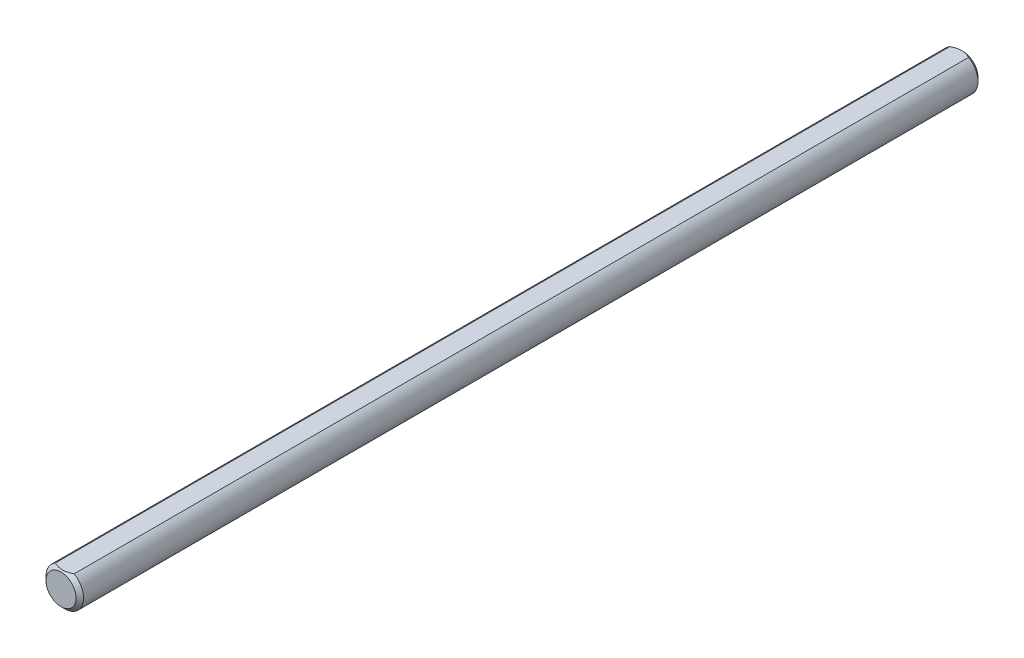
ISO-10303-21;
HEADER;
FILE_DESCRIPTION(('STEP AP214'),'2;1');
FILE_NAME('part.step','',(''),(''),'','','');
FILE_SCHEMA(('AUTOMOTIVE_DESIGN { 1 0 10303 214 1 1 1 1 }'));
ENDSEC;
DATA;
#1=APPLICATION_CONTEXT('core data for automotive mechanical design processes');
#2=APPLICATION_PROTOCOL_DEFINITION('international standard','automotive_design',2000,#1);
#3=PRODUCT_CONTEXT('',#1,'mechanical');
#4=PRODUCT('Part','Part','',(#3));
#5=PRODUCT_RELATED_PRODUCT_CATEGORY('part','',(#4));
#6=PRODUCT_DEFINITION_FORMATION('','',#4);
#7=PRODUCT_DEFINITION_CONTEXT('part definition',#1,'design');
#8=PRODUCT_DEFINITION('design','',#6,#7);
#9=PRODUCT_DEFINITION_SHAPE('','',#8);
#10=(LENGTH_UNIT() NAMED_UNIT(*) SI_UNIT(.MILLI.,.METRE.));
#11=(NAMED_UNIT(*) PLANE_ANGLE_UNIT() SI_UNIT($,.RADIAN.));
#12=(NAMED_UNIT(*) SI_UNIT($,.STERADIAN.) SOLID_ANGLE_UNIT());
#13=UNCERTAINTY_MEASURE_WITH_UNIT(LENGTH_MEASURE(1.E-05),#10,'distance_accuracy_value','');
#14=(GEOMETRIC_REPRESENTATION_CONTEXT(3) GLOBAL_UNCERTAINTY_ASSIGNED_CONTEXT((#13)) GLOBAL_UNIT_ASSIGNED_CONTEXT((#10,
#11,#12)) REPRESENTATION_CONTEXT('',''));
#15=CARTESIAN_POINT('',(0.,0.,0.));
#16=DIRECTION('',(0.,0.,1.));
#17=DIRECTION('',(1.,0.,0.));
#18=AXIS2_PLACEMENT_3D('',#15,#16,#17);
#19=CARTESIAN_POINT('',(0.,0.,76.2));
#20=DIRECTION('',(0.,0.,-1.));
#21=DIRECTION('',(-1.,0.,0.));
#22=AXIS2_PLACEMENT_3D('',#19,#20,#21);
#23=CYLINDRICAL_SURFACE('',#22,3.175);
#24=CARTESIAN_POINT('',(0.,0.,75.5650000000001));
#25=DIRECTION('',(0.,0.,1.));
#26=DIRECTION('',(1.,0.,0.));
#27=AXIS2_PLACEMENT_3D('',#24,#25,#26);
#28=CIRCLE('',#27,3.175);
#29=CARTESIAN_POINT('',(1.5875,2.74963065701559,75.5650000000001));
#30=VERTEX_POINT('',#29);
#31=CARTESIAN_POINT('',(-1.5875,2.74963065701559,75.5650000000001));
#32=VERTEX_POINT('',#31);
#33=EDGE_CURVE('E74',#30,#32,#28,.F.);
#34=ORIENTED_EDGE('',*,*,#33,.T.);
#35=DIRECTION('',(0.,0.,1.));
#36=VECTOR('',#35,1.);
#37=CARTESIAN_POINT('',(-1.5875,2.74963065701559,-76.2));
#38=LINE('',#37,#36);
#39=CARTESIAN_POINT('',(-1.5875,2.74963065701559,-75.5649999999999));
#40=VERTEX_POINT('',#39);
#41=EDGE_CURVE('E52',#40,#32,#38,.T.);
#42=ORIENTED_EDGE('',*,*,#41,.F.);
#43=CARTESIAN_POINT('',(0.,0.,-75.5649999999999));
#44=DIRECTION('',(0.,0.,1.));
#45=DIRECTION('',(1.,0.,0.));
#46=AXIS2_PLACEMENT_3D('',#43,#44,#45);
#47=CIRCLE('',#46,3.175);
#48=CARTESIAN_POINT('',(1.5875,2.74963065701559,-75.5649999999999));
#49=VERTEX_POINT('',#48);
#50=EDGE_CURVE('E73',#40,#49,#47,.T.);
#51=ORIENTED_EDGE('',*,*,#50,.T.);
#52=DIRECTION('',(0.,0.,1.));
#53=VECTOR('',#52,1.);
#54=CARTESIAN_POINT('',(1.5875,2.74963065701559,-76.2));
#55=LINE('',#54,#53);
#56=EDGE_CURVE('E62',#49,#30,#55,.T.);
#57=ORIENTED_EDGE('',*,*,#56,.T.);
#58=EDGE_LOOP('',(#34,#42,#51,#57));
#59=FACE_BOUND('',#58,.T.);
#60=ADVANCED_FACE('F32',(#59),#23,.T.);
#61=CARTESIAN_POINT('',(0.,0.,76.2));
#62=DIRECTION('',(0.,0.,1.));
#63=DIRECTION('',(1.,0.,0.));
#64=AXIS2_PLACEMENT_3D('',#61,#62,#63);
#65=PLANE('',#64);
#66=CARTESIAN_POINT('',(0.,0.,76.2));
#67=DIRECTION('',(0.,0.,1.));
#68=DIRECTION('',(1.,0.,0.));
#69=AXIS2_PLACEMENT_3D('',#66,#67,#68);
#70=CIRCLE('',#69,2.54000000000008);
#71=CARTESIAN_POINT('',(2.54000000000008,0.,76.2));
#72=VERTEX_POINT('',#71);
#73=EDGE_CURVE('E46',#72,#72,#70,.T.);
#74=ORIENTED_EDGE('',*,*,#73,.T.);
#75=EDGE_LOOP('',(#74));
#76=FACE_BOUND('',#75,.T.);
#77=ADVANCED_FACE('F84',(#76),#65,.T.);
#78=CARTESIAN_POINT('',(0.,0.,-76.2));
#79=DIRECTION('',(0.,0.,1.));
#80=DIRECTION('',(1.,0.,0.));
#81=AXIS2_PLACEMENT_3D('',#78,#79,#80);
#82=PLANE('',#81);
#83=CARTESIAN_POINT('',(0.,0.,-76.2));
#84=DIRECTION('',(0.,0.,1.));
#85=DIRECTION('',(1.,0.,0.));
#86=AXIS2_PLACEMENT_3D('',#83,#84,#85);
#87=CIRCLE('',#86,2.53999999999988);
#88=CARTESIAN_POINT('',(2.53999999999988,0.,-76.2));
#89=VERTEX_POINT('',#88);
#90=EDGE_CURVE('E76',#89,#89,#87,.F.);
#91=ORIENTED_EDGE('',*,*,#90,.T.);
#92=EDGE_LOOP('',(#91));
#93=FACE_BOUND('',#92,.T.);
#94=ADVANCED_FACE('F92',(#93),#82,.F.);
#95=CARTESIAN_POINT('',(0.,0.,-75.5649999999999));
#96=DIRECTION('',(0.,0.,1.));
#97=DIRECTION('',(1.,0.,0.));
#98=AXIS2_PLACEMENT_3D('',#95,#96,#97);
#99=CONICAL_SURFACE('',#98,3.175,0.785398163397441);
#100=CARTESIAN_POINT('',(-3.22896135223723,2.74963065701559,-74.4989317189837));
#101=CARTESIAN_POINT('',(-3.15061649550098,2.74963065701559,-74.5585665245459));
#102=CARTESIAN_POINT('',(-3.07184009651257,2.74963065701559,-74.6176434820249));
#103=CARTESIAN_POINT('',(-2.91325130568812,2.74963065701559,-74.7344297176182));
#104=CARTESIAN_POINT('',(-2.83343866506288,2.74963065701559,-74.7921386575257));
#105=CARTESIAN_POINT('',(-2.6720206285274,2.74963065701559,-74.906347547805));
#106=CARTESIAN_POINT('',(-2.59040613970423,2.74963065701559,-74.9628346895371));
#107=CARTESIAN_POINT('',(-2.42580311622158,2.74963065701559,-75.0737635143343));
#108=CARTESIAN_POINT('',(-2.3428146780933,2.74963065701559,-75.1282053402284));
#109=CARTESIAN_POINT('',(-2.17021447787224,2.74963065701559,-75.2377738711655));
#110=CARTESIAN_POINT('',(-2.08050398524188,2.74963065701559,-75.2927458353401));
#111=CARTESIAN_POINT('',(-1.89900904678686,2.74963065701559,-75.3991469931977));
#112=CARTESIAN_POINT('',(-1.80722487525631,2.74963065701559,-75.4505766518348));
#113=CARTESIAN_POINT('',(-1.62153760368926,2.74963065701559,-75.5488148050513));
#114=CARTESIAN_POINT('',(-1.5276414092249,2.74963065701559,-75.5956362501766));
#115=CARTESIAN_POINT('',(-1.33724706572097,2.74963065701559,-75.6836008153406));
#116=CARTESIAN_POINT('',(-1.24075014112705,2.74963065701559,-75.7247465535941));
#117=CARTESIAN_POINT('',(-1.05364742760746,2.74963065701559,-75.7965564372304));
#118=CARTESIAN_POINT('',(-0.96327642558862,2.74963065701559,-75.8278260439731));
#119=CARTESIAN_POINT('',(-0.780303735161088,2.74963065701559,-75.8831231873503));
#120=CARTESIAN_POINT('',(-0.687701898779448,2.74963065701559,-75.9071502421445));
#121=CARTESIAN_POINT('',(-0.502391431282842,2.74963065701559,-75.946288290841));
#122=CARTESIAN_POINT('',(-0.409716445146749,2.74963065701559,-75.9615559547488));
#123=CARTESIAN_POINT('',(-0.223306330685266,2.74963065701559,-75.9828688420293));
#124=CARTESIAN_POINT('',(-0.12957140343737,2.74963065701559,-75.988915786014));
#125=CARTESIAN_POINT('',(0.0543357559016697,2.74963065701559,-75.9913094852483));
#126=CARTESIAN_POINT('',(0.144503242552356,2.74963065701559,-75.9880280862277));
#127=CARTESIAN_POINT('',(0.324095543573396,2.74963065701559,-75.9727817719637));
#128=CARTESIAN_POINT('',(0.413520286896849,2.74963065701559,-75.9608160354813));
#129=CARTESIAN_POINT('',(0.592496066024053,2.74963065701559,-75.928661523536));
#130=CARTESIAN_POINT('',(0.682021177378998,2.74963065701559,-75.9083305801751));
#131=CARTESIAN_POINT('',(0.859103373963801,2.74963065701559,-75.8605451979539));
#132=CARTESIAN_POINT('',(0.946660601088758,2.74963065701559,-75.8330912745011));
#133=CARTESIAN_POINT('',(1.21954622680459,2.74963065701559,-75.7371294821896));
#134=CARTESIAN_POINT('',(1.40108594012661,2.74963065701559,-75.6578094527362));
#135=CARTESIAN_POINT('',(1.66675889489853,2.74963065701559,-75.5255539852256));
#136=CARTESIAN_POINT('',(1.7543748838501,2.74963065701559,-75.4791526611237));
#137=CARTESIAN_POINT('',(1.92761951465594,2.74963065701559,-75.3827692377676));
#138=CARTESIAN_POINT('',(2.0132485070545,2.74963065701559,-75.3327877765755));
#139=CARTESIAN_POINT('',(2.17855184285729,2.74963065701559,-75.232513843306));
#140=CARTESIAN_POINT('',(2.25831097248794,2.74963065701559,-75.1823595590395));
#141=CARTESIAN_POINT('',(2.4164611863999,2.74963065701559,-75.0799282177625));
#142=CARTESIAN_POINT('',(2.49485216688171,2.74963065701559,-75.0276510006804));
#143=CARTESIAN_POINT('',(2.64980987258622,2.74963065701559,-74.9217831250553));
#144=CARTESIAN_POINT('',(2.72638621983951,2.74963065701559,-74.8682064917738));
#145=CARTESIAN_POINT('',(2.87849044969159,2.74963065701559,-74.7596270900168));
#146=CARTESIAN_POINT('',(2.95401861519254,2.74963065701559,-74.704624718309));
#147=CARTESIAN_POINT('',(3.02910770969615,2.74963065701559,-74.6490389555825));
#148=B_SPLINE_CURVE_WITH_KNOTS('',3,(#100,#101,#102,#103,#104,#105,#106,#107,#108,#109,#110,
#111,#112,#113,#114,#115,#116,#117,#118,#119,#120,#121,#122,#123,#124,#125,#126,#127,#128,#129,
#130,#131,#132,#133,#134,#135,#136,#137,#138,#139,#140,#141,#142,#143,#144,#145,#146,#147),
.UNSPECIFIED.,.F.,.F.,(4,2,2,2,2,2,2,2,2,2,2,2,2,2,2,2,2,2,2,2,2,2,2,4),(0.,0.295383449271204,
0.590839178498781,0.888580871622932,1.18630173399067,1.50187785569753,1.81741247644343,
2.13203338294816,2.44650866534169,2.73314264689628,3.01979569373825,3.30114758261616,
3.58244696402017,3.85269226293483,4.12296312107177,4.39803055604388,4.6730780931186,
5.26557071241297,5.56297998480365,5.8603363833345,6.1429552359086,6.42559543796906,
6.70595195130099,6.98623126477245),.UNSPECIFIED.);
#149=EDGE_CURVE('E57',#49,#40,#148,.F.);
#150=ORIENTED_EDGE('',*,*,#149,.F.);
#151=ORIENTED_EDGE('',*,*,#50,.F.);
#152=EDGE_LOOP('',(#150,#151));
#153=FACE_BOUND('',#152,.T.);
#154=ORIENTED_EDGE('',*,*,#90,.F.);
#155=EDGE_LOOP('',(#154));
#156=FACE_BOUND('',#155,.T.);
#157=ADVANCED_FACE('F71',(#153,#156),#99,.T.);
#158=CARTESIAN_POINT('',(0.,0.,76.2));
#159=DIRECTION('',(0.,0.,-1.));
#160=DIRECTION('',(-1.,0.,0.));
#161=AXIS2_PLACEMENT_3D('',#158,#159,#160);
#162=CONICAL_SURFACE('',#161,2.54000000000008,0.785398163397452);
#163=CARTESIAN_POINT('',(-3.22896135223734,2.74963065701559,74.4989317189838));
#164=CARTESIAN_POINT('',(-3.15061649550109,2.74963065701559,74.5585665245461));
#165=CARTESIAN_POINT('',(-3.07184009651267,2.74963065701559,74.6176434820251));
#166=CARTESIAN_POINT('',(-2.91325130568822,2.74963065701559,74.7344297176184));
#167=CARTESIAN_POINT('',(-2.83343866506298,2.74963065701559,74.7921386575259));
#168=CARTESIAN_POINT('',(-2.6720206285275,2.74963065701559,74.9063475478052));
#169=CARTESIAN_POINT('',(-2.59040613970432,2.74963065701559,74.9628346895372));
#170=CARTESIAN_POINT('',(-2.42580311622166,2.74963065701559,75.0737635143345));
#171=CARTESIAN_POINT('',(-2.34281467809337,2.74963065701559,75.1282053402286));
#172=CARTESIAN_POINT('',(-2.17021447787231,2.74963065701559,75.2377738711657));
#173=CARTESIAN_POINT('',(-2.08050398524195,2.74963065701559,75.2927458353403));
#174=CARTESIAN_POINT('',(-1.89900904678693,2.74963065701559,75.3991469931979));
#175=CARTESIAN_POINT('',(-1.80722487525637,2.74963065701559,75.450576651835));
#176=CARTESIAN_POINT('',(-1.62153760368931,2.74963065701559,75.5488148050515));
#177=CARTESIAN_POINT('',(-1.52764140922495,2.74963065701559,75.5956362501768));
#178=CARTESIAN_POINT('',(-1.33724706572101,2.74963065701559,75.6836008153408));
#179=CARTESIAN_POINT('',(-1.24075014112709,2.74963065701559,75.7247465535943));
#180=CARTESIAN_POINT('',(-1.0536474276075,2.74963065701559,75.7965564372306));
#181=CARTESIAN_POINT('',(-0.963276425588651,2.74963065701559,75.8278260439733));
#182=CARTESIAN_POINT('',(-0.780303735161114,2.74963065701559,75.8831231873505));
#183=CARTESIAN_POINT('',(-0.68770189877947,2.74963065701559,75.9071502421447));
#184=CARTESIAN_POINT('',(-0.502391431282856,2.74963065701559,75.9462882908412));
#185=CARTESIAN_POINT('',(-0.409716445146758,2.74963065701559,75.961555954749));
#186=CARTESIAN_POINT('',(-0.223306330685266,2.74963065701559,75.9828688420295));
#187=CARTESIAN_POINT('',(-0.129571403437367,2.74963065701559,75.9889157860142));
#188=CARTESIAN_POINT('',(0.0543357559016806,2.74963065701559,75.9913094852486));
#189=CARTESIAN_POINT('',(0.144503242552371,2.74963065701559,75.9880280862279));
#190=CARTESIAN_POINT('',(0.324095543573417,2.74963065701559,75.9727817719639));
#191=CARTESIAN_POINT('',(0.413520286896872,2.74963065701559,75.9608160354815));
#192=CARTESIAN_POINT('',(0.592496066024079,2.74963065701559,75.9286615235362));
#193=CARTESIAN_POINT('',(0.682021177379025,2.74963065701559,75.9083305801753));
#194=CARTESIAN_POINT('',(0.859103373963831,2.74963065701559,75.860545197954));
#195=CARTESIAN_POINT('',(0.946660601088792,2.74963065701559,75.8330912745013));
#196=CARTESIAN_POINT('',(1.21954622680464,2.74963065701559,75.7371294821898));
#197=CARTESIAN_POINT('',(1.40108594012667,2.74963065701559,75.6578094527364));
#198=CARTESIAN_POINT('',(1.66675889489862,2.74963065701559,75.5255539852258));
#199=CARTESIAN_POINT('',(1.7543748838502,2.74963065701559,75.4791526611239));
#200=CARTESIAN_POINT('',(1.92761951465604,2.74963065701559,75.3827692377678));
#201=CARTESIAN_POINT('',(2.0132485070546,2.74963065701559,75.3327877765757));
#202=CARTESIAN_POINT('',(2.1785518428574,2.74963065701559,75.2325138433062));
#203=CARTESIAN_POINT('',(2.25831097248805,2.74963065701559,75.1823595590397));
#204=CARTESIAN_POINT('',(2.41646118640002,2.74963065701559,75.0799282177626));
#205=CARTESIAN_POINT('',(2.49485216688183,2.74963065701559,75.0276510006806));
#206=CARTESIAN_POINT('',(2.64980987258634,2.74963065701559,74.9217831250555));
#207=CARTESIAN_POINT('',(2.72638621983964,2.74963065701559,74.8682064917739));
#208=CARTESIAN_POINT('',(2.87849044969172,2.74963065701559,74.759627090017));
#209=CARTESIAN_POINT('',(2.95401861519267,2.74963065701559,74.7046247183091));
#210=CARTESIAN_POINT('',(3.02910770969629,2.74963065701559,74.6490389555826));
#211=B_SPLINE_CURVE_WITH_KNOTS('',3,(#163,#164,#165,#166,#167,#168,#169,#170,#171,#172,#173,
#174,#175,#176,#177,#178,#179,#180,#181,#182,#183,#184,#185,#186,#187,#188,#189,#190,#191,#192,
#193,#194,#195,#196,#197,#198,#199,#200,#201,#202,#203,#204,#205,#206,#207,#208,#209,#210),
.UNSPECIFIED.,.F.,.F.,(4,2,2,2,2,2,2,2,2,2,2,2,2,2,2,2,2,2,2,2,2,2,2,4),(0.,0.295383449271204,
0.590839178498794,0.888580871622965,1.18630173399071,1.50187785569758,1.81741247644349,
2.13203338294824,2.44650866534178,2.73314264689638,3.01979569373836,3.30114758261628,
3.5824469640203,3.85269226293498,4.12296312107192,4.39803055604403,4.67307809311876,
5.26557071241318,5.56297998480388,5.86033638333474,6.14295523590886,6.42559543796932,
6.70595195130127,6.98623126477273),.UNSPECIFIED.);
#212=EDGE_CURVE('E11',#32,#30,#211,.T.);
#213=ORIENTED_EDGE('',*,*,#212,.F.);
#214=ORIENTED_EDGE('',*,*,#33,.F.);
#215=EDGE_LOOP('',(#213,#214));
#216=FACE_BOUND('',#215,.T.);
#217=ORIENTED_EDGE('',*,*,#73,.F.);
#218=EDGE_LOOP('',(#217));
#219=FACE_BOUND('',#218,.T.);
#220=ADVANCED_FACE('F34',(#216,#219),#162,.T.);
#221=CARTESIAN_POINT('',(-1.5875,2.74963065701559,-76.2));
#222=DIRECTION('',(0.,-1.,0.));
#223=DIRECTION('',(0.,0.,-1.));
#224=AXIS2_PLACEMENT_3D('',#221,#222,#223);
#225=PLANE('',#224);
#226=ORIENTED_EDGE('',*,*,#149,.T.);
#227=ORIENTED_EDGE('',*,*,#41,.T.);
#228=ORIENTED_EDGE('',*,*,#212,.T.);
#229=ORIENTED_EDGE('',*,*,#56,.F.);
#230=EDGE_LOOP('',(#226,#227,#228,#229));
#231=FACE_BOUND('',#230,.T.);
#232=ADVANCED_FACE('F63',(#231),#225,.F.);
#233=CLOSED_SHELL('',(#60,#77,#94,#157,#220,#232));
#234=MANIFOLD_SOLID_BREP('B2',#233);
#235=ADVANCED_BREP_SHAPE_REPRESENTATION('',(#18,#234),#14);
#236=SHAPE_DEFINITION_REPRESENTATION(#9,#235);
ENDSEC;
END-ISO-10303-21;
